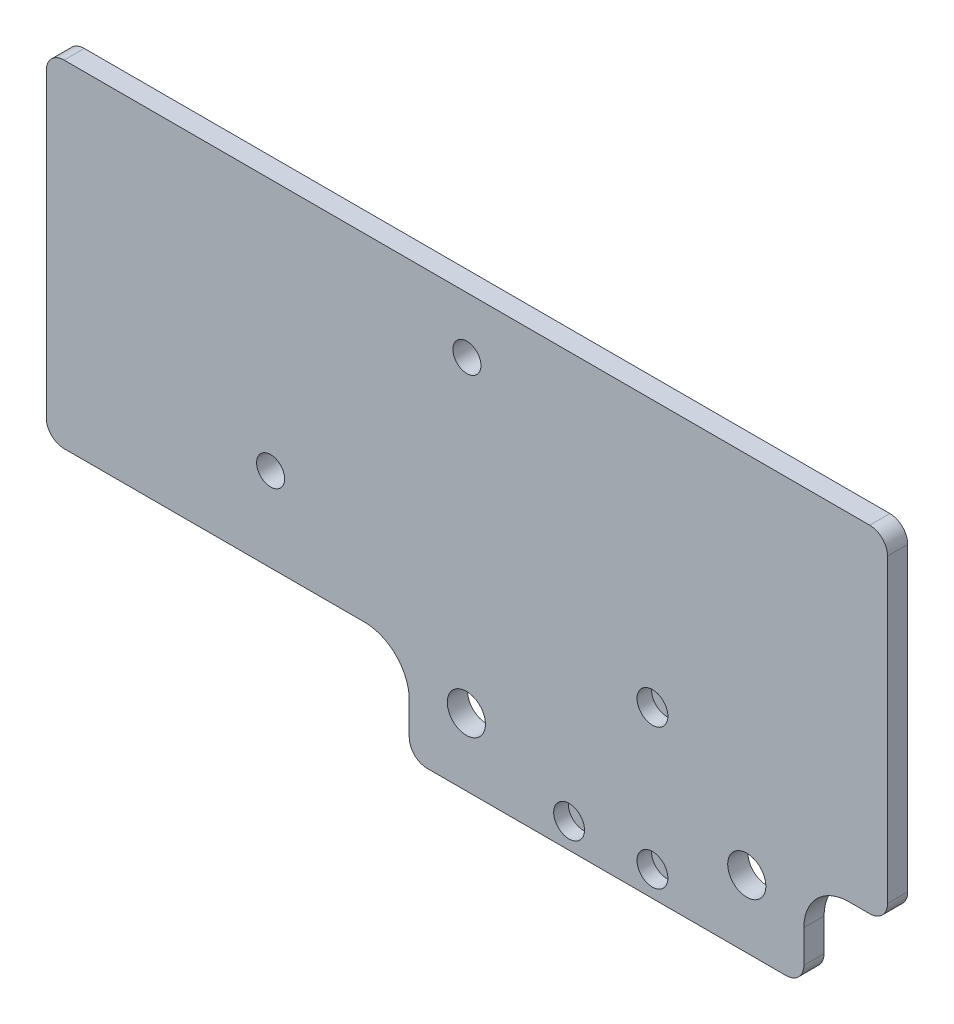
ISO-10303-21;
HEADER;
FILE_DESCRIPTION(('STEP AP214'),'2;1');
FILE_NAME('part.step','',(''),(''),'','','');
FILE_SCHEMA(('AUTOMOTIVE_DESIGN { 1 0 10303 214 1 1 1 1 }'));
ENDSEC;
DATA;
#1=APPLICATION_CONTEXT('core data for automotive mechanical design processes');
#2=APPLICATION_PROTOCOL_DEFINITION('international standard','automotive_design',2000,#1);
#3=PRODUCT_CONTEXT('',#1,'mechanical');
#4=PRODUCT('Part','Part','',(#3));
#5=PRODUCT_RELATED_PRODUCT_CATEGORY('part','',(#4));
#6=PRODUCT_DEFINITION_FORMATION('','',#4);
#7=PRODUCT_DEFINITION_CONTEXT('part definition',#1,'design');
#8=PRODUCT_DEFINITION('design','',#6,#7);
#9=PRODUCT_DEFINITION_SHAPE('','',#8);
#10=(LENGTH_UNIT() NAMED_UNIT(*) SI_UNIT(.MILLI.,.METRE.));
#11=(NAMED_UNIT(*) PLANE_ANGLE_UNIT() SI_UNIT($,.RADIAN.));
#12=(NAMED_UNIT(*) SI_UNIT($,.STERADIAN.) SOLID_ANGLE_UNIT());
#13=UNCERTAINTY_MEASURE_WITH_UNIT(LENGTH_MEASURE(1.E-05),#10,'distance_accuracy_value','');
#14=(GEOMETRIC_REPRESENTATION_CONTEXT(3) GLOBAL_UNCERTAINTY_ASSIGNED_CONTEXT((#13)) GLOBAL_UNIT_ASSIGNED_CONTEXT((#10,
#11,#12)) REPRESENTATION_CONTEXT('',''));
#15=CARTESIAN_POINT('',(0.,0.,0.));
#16=DIRECTION('',(0.,0.,1.));
#17=DIRECTION('',(1.,0.,0.));
#18=AXIS2_PLACEMENT_3D('',#15,#16,#17);
#19=CARTESIAN_POINT('',(33.0800000000001,-72.5,3.6));
#20=DIRECTION('',(0.,0.,-1.));
#21=DIRECTION('',(-1.,0.,0.));
#22=AXIS2_PLACEMENT_3D('',#19,#20,#21);
#23=CYLINDRICAL_SURFACE('',#22,2.75);
#24=CARTESIAN_POINT('',(33.0800000000001,-72.5,3.6));
#25=DIRECTION('',(0.,0.,1.));
#26=DIRECTION('',(1.,0.,0.));
#27=AXIS2_PLACEMENT_3D('',#24,#25,#26);
#28=CIRCLE('',#27,2.75);
#29=CARTESIAN_POINT('',(35.8300000000001,-72.5,3.6));
#30=VERTEX_POINT('',#29);
#31=EDGE_CURVE('E515',#30,#30,#28,.T.);
#32=ORIENTED_EDGE('',*,*,#31,.T.);
#33=EDGE_LOOP('',(#32));
#34=FACE_BOUND('',#33,.T.);
#35=CARTESIAN_POINT('',(33.0800000000001,-72.5,1.));
#36=DIRECTION('',(0.,0.,-1.));
#37=DIRECTION('',(-1.,0.,0.));
#38=AXIS2_PLACEMENT_3D('',#35,#36,#37);
#39=CIRCLE('',#38,2.75);
#40=CARTESIAN_POINT('',(30.3300000000001,-72.5,1.));
#41=VERTEX_POINT('',#40);
#42=EDGE_CURVE('E493',#41,#41,#39,.T.);
#43=ORIENTED_EDGE('',*,*,#42,.T.);
#44=EDGE_LOOP('',(#43));
#45=FACE_BOUND('',#44,.T.);
#46=ADVANCED_FACE('F38',(#34,#45),#23,.F.);
#47=CARTESIAN_POINT('',(18.22,-72.5,3.6));
#48=DIRECTION('',(0.,0.,-1.));
#49=DIRECTION('',(-1.,0.,0.));
#50=AXIS2_PLACEMENT_3D('',#47,#48,#49);
#51=CYLINDRICAL_SURFACE('',#50,2.75);
#52=CARTESIAN_POINT('',(18.22,-72.5,3.6));
#53=DIRECTION('',(0.,0.,1.));
#54=DIRECTION('',(1.,0.,0.));
#55=AXIS2_PLACEMENT_3D('',#52,#53,#54);
#56=CIRCLE('',#55,2.75);
#57=CARTESIAN_POINT('',(20.97,-72.5,3.6));
#58=VERTEX_POINT('',#57);
#59=EDGE_CURVE('E498',#58,#58,#56,.T.);
#60=ORIENTED_EDGE('',*,*,#59,.T.);
#61=EDGE_LOOP('',(#60));
#62=FACE_BOUND('',#61,.T.);
#63=CARTESIAN_POINT('',(18.22,-72.5,1.));
#64=DIRECTION('',(0.,0.,-1.));
#65=DIRECTION('',(-1.,0.,0.));
#66=AXIS2_PLACEMENT_3D('',#63,#64,#65);
#67=CIRCLE('',#66,2.75);
#68=CARTESIAN_POINT('',(15.47,-72.5,1.));
#69=VERTEX_POINT('',#68);
#70=EDGE_CURVE('E495',#69,#69,#67,.T.);
#71=ORIENTED_EDGE('',*,*,#70,.T.);
#72=EDGE_LOOP('',(#71));
#73=FACE_BOUND('',#72,.T.);
#74=ADVANCED_FACE('F320',(#62,#73),#51,.F.);
#75=CARTESIAN_POINT('',(33.0800000000001,-47.5,3.6));
#76=DIRECTION('',(0.,0.,-1.));
#77=DIRECTION('',(-1.,0.,0.));
#78=AXIS2_PLACEMENT_3D('',#75,#76,#77);
#79=CYLINDRICAL_SURFACE('',#78,2.75);
#80=CARTESIAN_POINT('',(33.0800000000001,-47.5,3.6));
#81=DIRECTION('',(0.,0.,1.));
#82=DIRECTION('',(1.,0.,0.));
#83=AXIS2_PLACEMENT_3D('',#80,#81,#82);
#84=CIRCLE('',#83,2.75);
#85=CARTESIAN_POINT('',(35.8300000000001,-47.5,3.6));
#86=VERTEX_POINT('',#85);
#87=EDGE_CURVE('E494',#86,#86,#84,.T.);
#88=ORIENTED_EDGE('',*,*,#87,.T.);
#89=EDGE_LOOP('',(#88));
#90=FACE_BOUND('',#89,.T.);
#91=CARTESIAN_POINT('',(33.0800000000001,-47.5,1.));
#92=DIRECTION('',(0.,0.,-1.));
#93=DIRECTION('',(-1.,0.,0.));
#94=AXIS2_PLACEMENT_3D('',#91,#92,#93);
#95=CIRCLE('',#94,2.75);
#96=CARTESIAN_POINT('',(30.3300000000001,-47.5,1.));
#97=VERTEX_POINT('',#96);
#98=EDGE_CURVE('E42',#97,#97,#95,.T.);
#99=ORIENTED_EDGE('',*,*,#98,.T.);
#100=EDGE_LOOP('',(#99));
#101=FACE_BOUND('',#100,.T.);
#102=ADVANCED_FACE('F326',(#90,#101),#79,.F.);
#103=CARTESIAN_POINT('',(71.82,-3.18000000000001,3.6));
#104=DIRECTION('',(0.,0.,1.));
#105=DIRECTION('',(1.,0.,0.));
#106=AXIS2_PLACEMENT_3D('',#103,#104,#105);
#107=PLANE('',#106);
#108=ORIENTED_EDGE('',*,*,#59,.F.);
#109=EDGE_LOOP('',(#108));
#110=FACE_BOUND('',#109,.T.);
#111=CARTESIAN_POINT('',(-0.0999999999999612,-65.,3.6));
#112=DIRECTION('',(0.,0.,1.));
#113=DIRECTION('',(1.,0.,0.));
#114=AXIS2_PLACEMENT_3D('',#111,#112,#113);
#115=CIRCLE('',#114,3.4);
#116=CARTESIAN_POINT('',(3.30000000000004,-65.,3.6));
#117=VERTEX_POINT('',#116);
#118=EDGE_CURVE('E512',#117,#117,#115,.T.);
#119=ORIENTED_EDGE('',*,*,#118,.F.);
#120=EDGE_LOOP('',(#119));
#121=FACE_BOUND('',#120,.T.);
#122=CARTESIAN_POINT('',(49.9,-65.,3.6));
#123=DIRECTION('',(0.,0.,1.));
#124=DIRECTION('',(1.,0.,0.));
#125=AXIS2_PLACEMENT_3D('',#122,#123,#124);
#126=CIRCLE('',#125,3.4);
#127=CARTESIAN_POINT('',(53.3,-65.,3.6));
#128=VERTEX_POINT('',#127);
#129=EDGE_CURVE('E520',#128,#128,#126,.T.);
#130=ORIENTED_EDGE('',*,*,#129,.F.);
#131=EDGE_LOOP('',(#130));
#132=FACE_BOUND('',#131,.T.);
#133=CARTESIAN_POINT('',(71.82,-3.18000000000001,3.6));
#134=DIRECTION('',(0.,0.,1.));
#135=DIRECTION('',(1.,0.,0.));
#136=AXIS2_PLACEMENT_3D('',#133,#134,#135);
#137=CIRCLE('',#136,3.18);
#138=CARTESIAN_POINT('',(75.,-3.18000000000001,3.6));
#139=VERTEX_POINT('',#138);
#140=CARTESIAN_POINT('',(71.82,0.,3.6));
#141=VERTEX_POINT('',#140);
#142=EDGE_CURVE('E216',#139,#141,#137,.T.);
#143=ORIENTED_EDGE('',*,*,#142,.T.);
#144=DIRECTION('',(-1.,0.,0.));
#145=VECTOR('',#144,1.);
#146=CARTESIAN_POINT('',(71.82,0.,3.6));
#147=LINE('',#146,#145);
#148=CARTESIAN_POINT('',(-71.82,0.,3.6));
#149=VERTEX_POINT('',#148);
#150=EDGE_CURVE('E123',#141,#149,#147,.T.);
#151=ORIENTED_EDGE('',*,*,#150,.T.);
#152=CARTESIAN_POINT('',(-71.82,-3.18000000000002,3.6));
#153=DIRECTION('',(0.,0.,1.));
#154=DIRECTION('',(1.,0.,0.));
#155=AXIS2_PLACEMENT_3D('',#152,#153,#154);
#156=CIRCLE('',#155,3.18);
#157=CARTESIAN_POINT('',(-75.,-3.18000000000002,3.6));
#158=VERTEX_POINT('',#157);
#159=EDGE_CURVE('E256',#149,#158,#156,.T.);
#160=ORIENTED_EDGE('',*,*,#159,.T.);
#161=DIRECTION('',(0.,-1.,0.));
#162=VECTOR('',#161,1.);
#163=CARTESIAN_POINT('',(-75.,-3.18000000000002,3.6));
#164=LINE('',#163,#162);
#165=CARTESIAN_POINT('',(-75.,-56.82,3.6));
#166=VERTEX_POINT('',#165);
#167=EDGE_CURVE('E276',#158,#166,#164,.T.);
#168=ORIENTED_EDGE('',*,*,#167,.T.);
#169=CARTESIAN_POINT('',(-71.82,-56.82,3.6));
#170=DIRECTION('',(0.,0.,1.));
#171=DIRECTION('',(1.,0.,0.));
#172=AXIS2_PLACEMENT_3D('',#169,#170,#171);
#173=CIRCLE('',#172,3.18000000000001);
#174=CARTESIAN_POINT('',(-71.82,-60.,3.6));
#175=VERTEX_POINT('',#174);
#176=EDGE_CURVE('E273',#166,#175,#173,.T.);
#177=ORIENTED_EDGE('',*,*,#176,.T.);
#178=DIRECTION('',(1.,0.,0.));
#179=VECTOR('',#178,1.);
#180=CARTESIAN_POINT('',(-71.82,-60.,3.6));
#181=LINE('',#180,#179);
#182=CARTESIAN_POINT('',(-18.28,-60.,3.6));
#183=VERTEX_POINT('',#182);
#184=EDGE_CURVE('E275',#175,#183,#181,.T.);
#185=ORIENTED_EDGE('',*,*,#184,.T.);
#186=CARTESIAN_POINT('',(-18.28,-68.,3.6));
#187=DIRECTION('',(0.,0.,-1.));
#188=DIRECTION('',(1.,0.,0.));
#189=AXIS2_PLACEMENT_3D('',#186,#187,#188);
#190=CIRCLE('',#189,8.);
#191=CARTESIAN_POINT('',(-10.28,-67.9999999999999,3.6));
#192=VERTEX_POINT('',#191);
#193=EDGE_CURVE('E278',#183,#192,#190,.T.);
#194=ORIENTED_EDGE('',*,*,#193,.T.);
#195=DIRECTION('',(0.,-1.,0.));
#196=VECTOR('',#195,1.);
#197=CARTESIAN_POINT('',(-10.28,-67.9999999999999,3.6));
#198=LINE('',#197,#196);
#199=CARTESIAN_POINT('',(-10.28,-73.8199999999999,3.6));
#200=VERTEX_POINT('',#199);
#201=EDGE_CURVE('E284',#192,#200,#198,.T.);
#202=ORIENTED_EDGE('',*,*,#201,.T.);
#203=CARTESIAN_POINT('',(-7.09999999999996,-73.82,3.6));
#204=DIRECTION('',(0.,0.,1.));
#205=DIRECTION('',(1.,0.,0.));
#206=AXIS2_PLACEMENT_3D('',#203,#204,#205);
#207=CIRCLE('',#206,3.18);
#208=CARTESIAN_POINT('',(-7.09999999999996,-77.,3.6));
#209=VERTEX_POINT('',#208);
#210=EDGE_CURVE('E286',#200,#209,#207,.T.);
#211=ORIENTED_EDGE('',*,*,#210,.T.);
#212=DIRECTION('',(1.,0.,0.));
#213=VECTOR('',#212,1.);
#214=CARTESIAN_POINT('',(-7.09999999999996,-77.,3.6));
#215=LINE('',#214,#213);
#216=CARTESIAN_POINT('',(56.9,-77.,3.6));
#217=VERTEX_POINT('',#216);
#218=EDGE_CURVE('E288',#209,#217,#215,.T.);
#219=ORIENTED_EDGE('',*,*,#218,.T.);
#220=CARTESIAN_POINT('',(56.9,-73.82,3.6));
#221=DIRECTION('',(0.,0.,1.));
#222=DIRECTION('',(1.,0.,0.));
#223=AXIS2_PLACEMENT_3D('',#220,#221,#222);
#224=CIRCLE('',#223,3.18);
#225=CARTESIAN_POINT('',(60.08,-73.8199999999999,3.6));
#226=VERTEX_POINT('',#225);
#227=EDGE_CURVE('E290',#217,#226,#224,.T.);
#228=ORIENTED_EDGE('',*,*,#227,.T.);
#229=DIRECTION('',(0.,1.,0.));
#230=VECTOR('',#229,1.);
#231=CARTESIAN_POINT('',(60.08,-73.8199999999999,3.6));
#232=LINE('',#231,#230);
#233=CARTESIAN_POINT('',(60.08,-67.9999999999999,3.6));
#234=VERTEX_POINT('',#233);
#235=EDGE_CURVE('E292',#226,#234,#232,.T.);
#236=ORIENTED_EDGE('',*,*,#235,.T.);
#237=CARTESIAN_POINT('',(68.08,-68.,3.6));
#238=DIRECTION('',(0.,0.,-1.));
#239=DIRECTION('',(1.,0.,0.));
#240=AXIS2_PLACEMENT_3D('',#237,#238,#239);
#241=CIRCLE('',#240,8.00000000000001);
#242=CARTESIAN_POINT('',(68.0800000000001,-60.,3.6));
#243=VERTEX_POINT('',#242);
#244=EDGE_CURVE('E167',#234,#243,#241,.T.);
#245=ORIENTED_EDGE('',*,*,#244,.T.);
#246=DIRECTION('',(1.,0.,0.));
#247=VECTOR('',#246,1.);
#248=CARTESIAN_POINT('',(68.0800000000001,-60.,3.6));
#249=LINE('',#248,#247);
#250=CARTESIAN_POINT('',(71.82,-60.,3.6));
#251=VERTEX_POINT('',#250);
#252=EDGE_CURVE('E160',#243,#251,#249,.T.);
#253=ORIENTED_EDGE('',*,*,#252,.T.);
#254=CARTESIAN_POINT('',(71.82,-56.82,3.6));
#255=DIRECTION('',(0.,0.,1.));
#256=DIRECTION('',(1.,0.,0.));
#257=AXIS2_PLACEMENT_3D('',#254,#255,#256);
#258=CIRCLE('',#257,3.18000000000001);
#259=CARTESIAN_POINT('',(75.,-56.82,3.6));
#260=VERTEX_POINT('',#259);
#261=EDGE_CURVE('E165',#251,#260,#258,.T.);
#262=ORIENTED_EDGE('',*,*,#261,.T.);
#263=DIRECTION('',(0.,1.,0.));
#264=VECTOR('',#263,1.);
#265=CARTESIAN_POINT('',(75.,-56.82,3.6));
#266=LINE('',#265,#264);
#267=EDGE_CURVE('E56',#260,#139,#266,.T.);
#268=ORIENTED_EDGE('',*,*,#267,.T.);
#269=EDGE_LOOP('',(#143,#151,#160,#168,#177,#185,#194,#202,#211,#219,#228,#236,#245,#253,#262,#268));
#270=FACE_BOUND('',#269,.T.);
#271=CARTESIAN_POINT('',(-35.,-45.,3.6));
#272=DIRECTION('',(0.,0.,1.));
#273=DIRECTION('',(1.,0.,0.));
#274=AXIS2_PLACEMENT_3D('',#271,#272,#273);
#275=CIRCLE('',#274,2.5);
#276=CARTESIAN_POINT('',(-32.5,-45.,3.6));
#277=VERTEX_POINT('',#276);
#278=EDGE_CURVE('E189',#277,#277,#275,.T.);
#279=ORIENTED_EDGE('',*,*,#278,.F.);
#280=EDGE_LOOP('',(#279));
#281=FACE_BOUND('',#280,.T.);
#282=ORIENTED_EDGE('',*,*,#31,.F.);
#283=EDGE_LOOP('',(#282));
#284=FACE_BOUND('',#283,.T.);
#285=CARTESIAN_POINT('',(0.,-9.99999999999998,3.6));
#286=DIRECTION('',(0.,0.,1.));
#287=DIRECTION('',(1.,0.,0.));
#288=AXIS2_PLACEMENT_3D('',#285,#286,#287);
#289=CIRCLE('',#288,2.5);
#290=CARTESIAN_POINT('',(2.5,-9.99999999999998,3.6));
#291=VERTEX_POINT('',#290);
#292=EDGE_CURVE('E506',#291,#291,#289,.T.);
#293=ORIENTED_EDGE('',*,*,#292,.F.);
#294=EDGE_LOOP('',(#293));
#295=FACE_BOUND('',#294,.T.);
#296=ORIENTED_EDGE('',*,*,#87,.F.);
#297=EDGE_LOOP('',(#296));
#298=FACE_BOUND('',#297,.T.);
#299=ADVANCED_FACE('F162',(#110,#121,#132,#270,#281,#284,#295,#298),#107,.T.);
#300=CARTESIAN_POINT('',(71.82,-3.18000000000001,0.));
#301=DIRECTION('',(0.,0.,1.));
#302=DIRECTION('',(1.,0.,0.));
#303=AXIS2_PLACEMENT_3D('',#300,#301,#302);
#304=PLANE('',#303);
#305=CARTESIAN_POINT('',(56.9,-73.82,0.));
#306=DIRECTION('',(0.,0.,1.));
#307=DIRECTION('',(1.,0.,0.));
#308=AXIS2_PLACEMENT_3D('',#305,#306,#307);
#309=CIRCLE('',#308,3.18);
#310=CARTESIAN_POINT('',(56.9,-77.,0.));
#311=VERTEX_POINT('',#310);
#312=CARTESIAN_POINT('',(60.08,-73.8199999999999,0.));
#313=VERTEX_POINT('',#312);
#314=EDGE_CURVE('E207',#311,#313,#309,.T.);
#315=ORIENTED_EDGE('',*,*,#314,.F.);
#316=DIRECTION('',(1.,0.,0.));
#317=VECTOR('',#316,1.);
#318=CARTESIAN_POINT('',(-7.09999999999996,-77.,0.));
#319=LINE('',#318,#317);
#320=CARTESIAN_POINT('',(-7.09999999999996,-77.,0.));
#321=VERTEX_POINT('',#320);
#322=EDGE_CURVE('E205',#321,#311,#319,.T.);
#323=ORIENTED_EDGE('',*,*,#322,.F.);
#324=CARTESIAN_POINT('',(-7.09999999999996,-73.82,0.));
#325=DIRECTION('',(0.,0.,1.));
#326=DIRECTION('',(1.,0.,0.));
#327=AXIS2_PLACEMENT_3D('',#324,#325,#326);
#328=CIRCLE('',#327,3.18);
#329=CARTESIAN_POINT('',(-10.28,-73.8199999999999,0.));
#330=VERTEX_POINT('',#329);
#331=EDGE_CURVE('E203',#330,#321,#328,.T.);
#332=ORIENTED_EDGE('',*,*,#331,.F.);
#333=DIRECTION('',(0.,-1.,0.));
#334=VECTOR('',#333,1.);
#335=CARTESIAN_POINT('',(-10.28,-67.9999999999999,0.));
#336=LINE('',#335,#334);
#337=CARTESIAN_POINT('',(-10.28,-67.9999999999999,0.));
#338=VERTEX_POINT('',#337);
#339=EDGE_CURVE('E201',#338,#330,#336,.T.);
#340=ORIENTED_EDGE('',*,*,#339,.F.);
#341=CARTESIAN_POINT('',(-18.28,-68.,0.));
#342=DIRECTION('',(0.,0.,-1.));
#343=DIRECTION('',(1.,0.,0.));
#344=AXIS2_PLACEMENT_3D('',#341,#342,#343);
#345=CIRCLE('',#344,8.);
#346=CARTESIAN_POINT('',(-18.28,-60.,0.));
#347=VERTEX_POINT('',#346);
#348=EDGE_CURVE('E199',#347,#338,#345,.T.);
#349=ORIENTED_EDGE('',*,*,#348,.F.);
#350=DIRECTION('',(1.,0.,0.));
#351=VECTOR('',#350,1.);
#352=CARTESIAN_POINT('',(-71.82,-60.,0.));
#353=LINE('',#352,#351);
#354=CARTESIAN_POINT('',(-71.82,-60.,0.));
#355=VERTEX_POINT('',#354);
#356=EDGE_CURVE('E197',#355,#347,#353,.T.);
#357=ORIENTED_EDGE('',*,*,#356,.F.);
#358=CARTESIAN_POINT('',(-71.82,-56.82,0.));
#359=DIRECTION('',(0.,0.,1.));
#360=DIRECTION('',(1.,0.,0.));
#361=AXIS2_PLACEMENT_3D('',#358,#359,#360);
#362=CIRCLE('',#361,3.18000000000001);
#363=CARTESIAN_POINT('',(-75.,-56.82,0.));
#364=VERTEX_POINT('',#363);
#365=EDGE_CURVE('E195',#364,#355,#362,.T.);
#366=ORIENTED_EDGE('',*,*,#365,.F.);
#367=DIRECTION('',(0.,-1.,0.));
#368=VECTOR('',#367,1.);
#369=CARTESIAN_POINT('',(-75.,-3.18000000000002,0.));
#370=LINE('',#369,#368);
#371=CARTESIAN_POINT('',(-75.,-3.18000000000002,0.));
#372=VERTEX_POINT('',#371);
#373=EDGE_CURVE('E193',#372,#364,#370,.T.);
#374=ORIENTED_EDGE('',*,*,#373,.F.);
#375=CARTESIAN_POINT('',(-71.82,-3.18000000000002,0.));
#376=DIRECTION('',(0.,0.,1.));
#377=DIRECTION('',(1.,0.,0.));
#378=AXIS2_PLACEMENT_3D('',#375,#376,#377);
#379=CIRCLE('',#378,3.18);
#380=CARTESIAN_POINT('',(-71.82,0.,0.));
#381=VERTEX_POINT('',#380);
#382=EDGE_CURVE('E191',#381,#372,#379,.T.);
#383=ORIENTED_EDGE('',*,*,#382,.F.);
#384=DIRECTION('',(-1.,0.,0.));
#385=VECTOR('',#384,1.);
#386=CARTESIAN_POINT('',(71.82,0.,0.));
#387=LINE('',#386,#385);
#388=CARTESIAN_POINT('',(71.82,0.,0.));
#389=VERTEX_POINT('',#388);
#390=EDGE_CURVE('E188',#389,#381,#387,.T.);
#391=ORIENTED_EDGE('',*,*,#390,.F.);
#392=CARTESIAN_POINT('',(71.82,-3.18000000000001,0.));
#393=DIRECTION('',(0.,0.,1.));
#394=DIRECTION('',(1.,0.,0.));
#395=AXIS2_PLACEMENT_3D('',#392,#393,#394);
#396=CIRCLE('',#395,3.18);
#397=CARTESIAN_POINT('',(75.,-3.18000000000001,0.));
#398=VERTEX_POINT('',#397);
#399=EDGE_CURVE('E185',#398,#389,#396,.T.);
#400=ORIENTED_EDGE('',*,*,#399,.F.);
#401=DIRECTION('',(0.,1.,0.));
#402=VECTOR('',#401,1.);
#403=CARTESIAN_POINT('',(75.,-56.82,0.));
#404=LINE('',#403,#402);
#405=CARTESIAN_POINT('',(75.,-56.82,0.));
#406=VERTEX_POINT('',#405);
#407=EDGE_CURVE('E115',#406,#398,#404,.T.);
#408=ORIENTED_EDGE('',*,*,#407,.F.);
#409=CARTESIAN_POINT('',(71.82,-56.82,0.));
#410=DIRECTION('',(0.,0.,1.));
#411=DIRECTION('',(1.,0.,0.));
#412=AXIS2_PLACEMENT_3D('',#409,#410,#411);
#413=CIRCLE('',#412,3.18000000000001);
#414=CARTESIAN_POINT('',(71.82,-60.,0.));
#415=VERTEX_POINT('',#414);
#416=EDGE_CURVE('E109',#415,#406,#413,.T.);
#417=ORIENTED_EDGE('',*,*,#416,.F.);
#418=DIRECTION('',(1.,0.,0.));
#419=VECTOR('',#418,1.);
#420=CARTESIAN_POINT('',(68.0800000000001,-60.,0.));
#421=LINE('',#420,#419);
#422=CARTESIAN_POINT('',(68.0800000000001,-60.,0.));
#423=VERTEX_POINT('',#422);
#424=EDGE_CURVE('E175',#423,#415,#421,.T.);
#425=ORIENTED_EDGE('',*,*,#424,.F.);
#426=CARTESIAN_POINT('',(68.08,-68.,0.));
#427=DIRECTION('',(0.,0.,-1.));
#428=DIRECTION('',(1.,0.,0.));
#429=AXIS2_PLACEMENT_3D('',#426,#427,#428);
#430=CIRCLE('',#429,8.00000000000001);
#431=CARTESIAN_POINT('',(60.08,-67.9999999999999,0.));
#432=VERTEX_POINT('',#431);
#433=EDGE_CURVE('E211',#432,#423,#430,.T.);
#434=ORIENTED_EDGE('',*,*,#433,.F.);
#435=DIRECTION('',(0.,1.,0.));
#436=VECTOR('',#435,1.);
#437=CARTESIAN_POINT('',(60.08,-73.8199999999999,0.));
#438=LINE('',#437,#436);
#439=EDGE_CURVE('E209',#313,#432,#438,.T.);
#440=ORIENTED_EDGE('',*,*,#439,.F.);
#441=EDGE_LOOP('',(#315,#323,#332,#340,#349,#357,#366,#374,#383,#391,#400,#408,#417,#425,#434,#440));
#442=FACE_BOUND('',#441,.T.);
#443=CARTESIAN_POINT('',(-35.,-45.,0.));
#444=DIRECTION('',(0.,0.,1.));
#445=DIRECTION('',(1.,0.,0.));
#446=AXIS2_PLACEMENT_3D('',#443,#444,#445);
#447=CIRCLE('',#446,2.5);
#448=CARTESIAN_POINT('',(-32.5,-45.,0.));
#449=VERTEX_POINT('',#448);
#450=EDGE_CURVE('E523',#449,#449,#447,.T.);
#451=ORIENTED_EDGE('',*,*,#450,.T.);
#452=EDGE_LOOP('',(#451));
#453=FACE_BOUND('',#452,.T.);
#454=CARTESIAN_POINT('',(49.9,-65.,0.));
#455=DIRECTION('',(0.,0.,1.));
#456=DIRECTION('',(1.,0.,0.));
#457=AXIS2_PLACEMENT_3D('',#454,#455,#456);
#458=CIRCLE('',#457,3.4);
#459=CARTESIAN_POINT('',(53.3,-65.,0.));
#460=VERTEX_POINT('',#459);
#461=EDGE_CURVE('E519',#460,#460,#458,.T.);
#462=ORIENTED_EDGE('',*,*,#461,.T.);
#463=EDGE_LOOP('',(#462));
#464=FACE_BOUND('',#463,.T.);
#465=CARTESIAN_POINT('',(-0.0999999999999612,-65.,0.));
#466=DIRECTION('',(0.,0.,1.));
#467=DIRECTION('',(1.,0.,0.));
#468=AXIS2_PLACEMENT_3D('',#465,#466,#467);
#469=CIRCLE('',#468,3.4);
#470=CARTESIAN_POINT('',(3.30000000000004,-65.,0.));
#471=VERTEX_POINT('',#470);
#472=EDGE_CURVE('E509',#471,#471,#469,.T.);
#473=ORIENTED_EDGE('',*,*,#472,.T.);
#474=EDGE_LOOP('',(#473));
#475=FACE_BOUND('',#474,.T.);
#476=CARTESIAN_POINT('',(0.,-9.99999999999998,0.));
#477=DIRECTION('',(0.,0.,1.));
#478=DIRECTION('',(1.,0.,0.));
#479=AXIS2_PLACEMENT_3D('',#476,#477,#478);
#480=CIRCLE('',#479,2.5);
#481=CARTESIAN_POINT('',(2.5,-9.99999999999998,0.));
#482=VERTEX_POINT('',#481);
#483=EDGE_CURVE('E505',#482,#482,#480,.T.);
#484=ORIENTED_EDGE('',*,*,#483,.T.);
#485=EDGE_LOOP('',(#484));
#486=FACE_BOUND('',#485,.T.);
#487=ADVANCED_FACE('F260',(#442,#453,#464,#475,#486),#304,.F.);
#488=CARTESIAN_POINT('',(71.82,-3.18000000000001,3.6));
#489=DIRECTION('',(0.,0.,-1.));
#490=DIRECTION('',(-1.,0.,0.));
#491=AXIS2_PLACEMENT_3D('',#488,#489,#490);
#492=CYLINDRICAL_SURFACE('',#491,3.18);
#493=ORIENTED_EDGE('',*,*,#399,.T.);
#494=DIRECTION('',(0.,0.,-1.));
#495=VECTOR('',#494,1.);
#496=CARTESIAN_POINT('',(71.82,0.,3.6));
#497=LINE('',#496,#495);
#498=EDGE_CURVE('E11',#141,#389,#497,.T.);
#499=ORIENTED_EDGE('',*,*,#498,.F.);
#500=ORIENTED_EDGE('',*,*,#142,.F.);
#501=DIRECTION('',(0.,0.,-1.));
#502=VECTOR('',#501,1.);
#503=CARTESIAN_POINT('',(75.,-3.18000000000001,3.6));
#504=LINE('',#503,#502);
#505=EDGE_CURVE('E181',#139,#398,#504,.T.);
#506=ORIENTED_EDGE('',*,*,#505,.T.);
#507=EDGE_LOOP('',(#493,#499,#500,#506));
#508=FACE_BOUND('',#507,.T.);
#509=ADVANCED_FACE('F40',(#508),#492,.T.);
#510=CARTESIAN_POINT('',(71.82,0.,3.6));
#511=DIRECTION('',(0.,-1.,0.));
#512=DIRECTION('',(1.,0.,0.));
#513=AXIS2_PLACEMENT_3D('',#510,#511,#512);
#514=PLANE('',#513);
#515=ORIENTED_EDGE('',*,*,#390,.T.);
#516=DIRECTION('',(0.,0.,-1.));
#517=VECTOR('',#516,1.);
#518=CARTESIAN_POINT('',(-71.82,0.,3.6));
#519=LINE('',#518,#517);
#520=EDGE_CURVE('E48',#149,#381,#519,.T.);
#521=ORIENTED_EDGE('',*,*,#520,.F.);
#522=ORIENTED_EDGE('',*,*,#150,.F.);
#523=ORIENTED_EDGE('',*,*,#498,.T.);
#524=EDGE_LOOP('',(#515,#521,#522,#523));
#525=FACE_BOUND('',#524,.T.);
#526=ADVANCED_FACE('F344',(#525),#514,.F.);
#527=CARTESIAN_POINT('',(-71.82,-3.18000000000002,3.6));
#528=DIRECTION('',(0.,0.,-1.));
#529=DIRECTION('',(-1.,0.,0.));
#530=AXIS2_PLACEMENT_3D('',#527,#528,#529);
#531=CYLINDRICAL_SURFACE('',#530,3.18);
#532=ORIENTED_EDGE('',*,*,#382,.T.);
#533=DIRECTION('',(0.,0.,-1.));
#534=VECTOR('',#533,1.);
#535=CARTESIAN_POINT('',(-75.,-3.18000000000002,3.6));
#536=LINE('',#535,#534);
#537=EDGE_CURVE('E247',#158,#372,#536,.T.);
#538=ORIENTED_EDGE('',*,*,#537,.F.);
#539=ORIENTED_EDGE('',*,*,#159,.F.);
#540=ORIENTED_EDGE('',*,*,#520,.T.);
#541=EDGE_LOOP('',(#532,#538,#539,#540));
#542=FACE_BOUND('',#541,.T.);
#543=ADVANCED_FACE('F254',(#542),#531,.T.);
#544=CARTESIAN_POINT('',(-75.,-3.18000000000002,3.6));
#545=DIRECTION('',(1.,0.,0.));
#546=DIRECTION('',(0.,0.,-1.));
#547=AXIS2_PLACEMENT_3D('',#544,#545,#546);
#548=PLANE('',#547);
#549=ORIENTED_EDGE('',*,*,#373,.T.);
#550=DIRECTION('',(0.,0.,-1.));
#551=VECTOR('',#550,1.);
#552=CARTESIAN_POINT('',(-75.,-56.82,3.6));
#553=LINE('',#552,#551);
#554=EDGE_CURVE('E244',#166,#364,#553,.T.);
#555=ORIENTED_EDGE('',*,*,#554,.F.);
#556=ORIENTED_EDGE('',*,*,#167,.F.);
#557=ORIENTED_EDGE('',*,*,#537,.T.);
#558=EDGE_LOOP('',(#549,#555,#556,#557));
#559=FACE_BOUND('',#558,.T.);
#560=ADVANCED_FACE('F267',(#559),#548,.F.);
#561=CARTESIAN_POINT('',(-71.82,-56.82,3.6));
#562=DIRECTION('',(0.,0.,-1.));
#563=DIRECTION('',(-1.,0.,0.));
#564=AXIS2_PLACEMENT_3D('',#561,#562,#563);
#565=CYLINDRICAL_SURFACE('',#564,3.18000000000001);
#566=ORIENTED_EDGE('',*,*,#365,.T.);
#567=DIRECTION('',(0.,0.,-1.));
#568=VECTOR('',#567,1.);
#569=CARTESIAN_POINT('',(-71.82,-60.,3.6));
#570=LINE('',#569,#568);
#571=EDGE_CURVE('E241',#175,#355,#570,.T.);
#572=ORIENTED_EDGE('',*,*,#571,.F.);
#573=ORIENTED_EDGE('',*,*,#176,.F.);
#574=ORIENTED_EDGE('',*,*,#554,.T.);
#575=EDGE_LOOP('',(#566,#572,#573,#574));
#576=FACE_BOUND('',#575,.T.);
#577=ADVANCED_FACE('F271',(#576),#565,.T.);
#578=CARTESIAN_POINT('',(-71.82,-60.,3.6));
#579=DIRECTION('',(0.,1.,0.));
#580=DIRECTION('',(0.,0.,1.));
#581=AXIS2_PLACEMENT_3D('',#578,#579,#580);
#582=PLANE('',#581);
#583=ORIENTED_EDGE('',*,*,#356,.T.);
#584=DIRECTION('',(0.,0.,-1.));
#585=VECTOR('',#584,1.);
#586=CARTESIAN_POINT('',(-18.28,-60.,3.6));
#587=LINE('',#586,#585);
#588=EDGE_CURVE('E238',#183,#347,#587,.T.);
#589=ORIENTED_EDGE('',*,*,#588,.F.);
#590=ORIENTED_EDGE('',*,*,#184,.F.);
#591=ORIENTED_EDGE('',*,*,#571,.T.);
#592=EDGE_LOOP('',(#583,#589,#590,#591));
#593=FACE_BOUND('',#592,.T.);
#594=ADVANCED_FACE('F357',(#593),#582,.F.);
#595=CARTESIAN_POINT('',(-18.28,-68.,3.6));
#596=DIRECTION('',(0.,0.,-1.));
#597=DIRECTION('',(-1.,0.,0.));
#598=AXIS2_PLACEMENT_3D('',#595,#596,#597);
#599=CYLINDRICAL_SURFACE('',#598,8.);
#600=ORIENTED_EDGE('',*,*,#348,.T.);
#601=DIRECTION('',(0.,0.,-1.));
#602=VECTOR('',#601,1.);
#603=CARTESIAN_POINT('',(-10.28,-67.9999999999999,3.6));
#604=LINE('',#603,#602);
#605=EDGE_CURVE('E235',#192,#338,#604,.T.);
#606=ORIENTED_EDGE('',*,*,#605,.F.);
#607=ORIENTED_EDGE('',*,*,#193,.F.);
#608=ORIENTED_EDGE('',*,*,#588,.T.);
#609=EDGE_LOOP('',(#600,#606,#607,#608));
#610=FACE_BOUND('',#609,.T.);
#611=ADVANCED_FACE('F360',(#610),#599,.F.);
#612=CARTESIAN_POINT('',(-10.28,-67.9999999999999,3.6));
#613=DIRECTION('',(1.,0.,0.));
#614=DIRECTION('',(0.,1.,0.));
#615=AXIS2_PLACEMENT_3D('',#612,#613,#614);
#616=PLANE('',#615);
#617=ORIENTED_EDGE('',*,*,#339,.T.);
#618=DIRECTION('',(0.,0.,-1.));
#619=VECTOR('',#618,1.);
#620=CARTESIAN_POINT('',(-10.28,-73.8199999999999,3.6));
#621=LINE('',#620,#619);
#622=EDGE_CURVE('E232',#200,#330,#621,.T.);
#623=ORIENTED_EDGE('',*,*,#622,.F.);
#624=ORIENTED_EDGE('',*,*,#201,.F.);
#625=ORIENTED_EDGE('',*,*,#605,.T.);
#626=EDGE_LOOP('',(#617,#623,#624,#625));
#627=FACE_BOUND('',#626,.T.);
#628=ADVANCED_FACE('F364',(#627),#616,.F.);
#629=CARTESIAN_POINT('',(-7.09999999999996,-73.82,3.6));
#630=DIRECTION('',(0.,0.,-1.));
#631=DIRECTION('',(-1.,0.,0.));
#632=AXIS2_PLACEMENT_3D('',#629,#630,#631);
#633=CYLINDRICAL_SURFACE('',#632,3.18);
#634=ORIENTED_EDGE('',*,*,#331,.T.);
#635=DIRECTION('',(0.,0.,-1.));
#636=VECTOR('',#635,1.);
#637=CARTESIAN_POINT('',(-7.09999999999996,-77.,3.6));
#638=LINE('',#637,#636);
#639=EDGE_CURVE('E229',#209,#321,#638,.T.);
#640=ORIENTED_EDGE('',*,*,#639,.F.);
#641=ORIENTED_EDGE('',*,*,#210,.F.);
#642=ORIENTED_EDGE('',*,*,#622,.T.);
#643=EDGE_LOOP('',(#634,#640,#641,#642));
#644=FACE_BOUND('',#643,.T.);
#645=ADVANCED_FACE('F368',(#644),#633,.T.);
#646=CARTESIAN_POINT('',(-7.09999999999996,-77.,3.6));
#647=DIRECTION('',(0.,1.,0.));
#648=DIRECTION('',(0.,0.,1.));
#649=AXIS2_PLACEMENT_3D('',#646,#647,#648);
#650=PLANE('',#649);
#651=ORIENTED_EDGE('',*,*,#322,.T.);
#652=DIRECTION('',(0.,0.,-1.));
#653=VECTOR('',#652,1.);
#654=CARTESIAN_POINT('',(56.9,-77.,3.6));
#655=LINE('',#654,#653);
#656=EDGE_CURVE('E226',#217,#311,#655,.T.);
#657=ORIENTED_EDGE('',*,*,#656,.F.);
#658=ORIENTED_EDGE('',*,*,#218,.F.);
#659=ORIENTED_EDGE('',*,*,#639,.T.);
#660=EDGE_LOOP('',(#651,#657,#658,#659));
#661=FACE_BOUND('',#660,.T.);
#662=ADVANCED_FACE('F372',(#661),#650,.F.);
#663=CARTESIAN_POINT('',(56.9,-73.82,3.6));
#664=DIRECTION('',(0.,0.,-1.));
#665=DIRECTION('',(-1.,0.,0.));
#666=AXIS2_PLACEMENT_3D('',#663,#664,#665);
#667=CYLINDRICAL_SURFACE('',#666,3.18);
#668=ORIENTED_EDGE('',*,*,#314,.T.);
#669=DIRECTION('',(0.,0.,-1.));
#670=VECTOR('',#669,1.);
#671=CARTESIAN_POINT('',(60.08,-73.8199999999999,3.6));
#672=LINE('',#671,#670);
#673=EDGE_CURVE('E223',#226,#313,#672,.T.);
#674=ORIENTED_EDGE('',*,*,#673,.F.);
#675=ORIENTED_EDGE('',*,*,#227,.F.);
#676=ORIENTED_EDGE('',*,*,#656,.T.);
#677=EDGE_LOOP('',(#668,#674,#675,#676));
#678=FACE_BOUND('',#677,.T.);
#679=ADVANCED_FACE('F376',(#678),#667,.T.);
#680=CARTESIAN_POINT('',(60.08,-73.8199999999999,3.6));
#681=DIRECTION('',(-1.,0.,0.));
#682=DIRECTION('',(0.,-1.,0.));
#683=AXIS2_PLACEMENT_3D('',#680,#681,#682);
#684=PLANE('',#683);
#685=ORIENTED_EDGE('',*,*,#439,.T.);
#686=DIRECTION('',(0.,0.,-1.));
#687=VECTOR('',#686,1.);
#688=CARTESIAN_POINT('',(60.08,-67.9999999999999,3.6));
#689=LINE('',#688,#687);
#690=EDGE_CURVE('E220',#234,#432,#689,.T.);
#691=ORIENTED_EDGE('',*,*,#690,.F.);
#692=ORIENTED_EDGE('',*,*,#235,.F.);
#693=ORIENTED_EDGE('',*,*,#673,.T.);
#694=EDGE_LOOP('',(#685,#691,#692,#693));
#695=FACE_BOUND('',#694,.T.);
#696=ADVANCED_FACE('F298',(#695),#684,.F.);
#697=CARTESIAN_POINT('',(68.08,-68.,3.6));
#698=DIRECTION('',(0.,0.,-1.));
#699=DIRECTION('',(-1.,0.,0.));
#700=AXIS2_PLACEMENT_3D('',#697,#698,#699);
#701=CYLINDRICAL_SURFACE('',#700,8.00000000000001);
#702=ORIENTED_EDGE('',*,*,#433,.T.);
#703=DIRECTION('',(0.,0.,-1.));
#704=VECTOR('',#703,1.);
#705=CARTESIAN_POINT('',(68.0800000000001,-60.,3.6));
#706=LINE('',#705,#704);
#707=EDGE_CURVE('E176',#243,#423,#706,.T.);
#708=ORIENTED_EDGE('',*,*,#707,.F.);
#709=ORIENTED_EDGE('',*,*,#244,.F.);
#710=ORIENTED_EDGE('',*,*,#690,.T.);
#711=EDGE_LOOP('',(#702,#708,#709,#710));
#712=FACE_BOUND('',#711,.T.);
#713=ADVANCED_FACE('F302',(#712),#701,.F.);
#714=CARTESIAN_POINT('',(68.0800000000001,-60.,3.6));
#715=DIRECTION('',(0.,1.,0.));
#716=DIRECTION('',(-1.,0.,0.));
#717=AXIS2_PLACEMENT_3D('',#714,#715,#716);
#718=PLANE('',#717);
#719=ORIENTED_EDGE('',*,*,#424,.T.);
#720=DIRECTION('',(0.,0.,-1.));
#721=VECTOR('',#720,1.);
#722=CARTESIAN_POINT('',(71.82,-60.,3.6));
#723=LINE('',#722,#721);
#724=EDGE_CURVE('E172',#251,#415,#723,.T.);
#725=ORIENTED_EDGE('',*,*,#724,.F.);
#726=ORIENTED_EDGE('',*,*,#252,.F.);
#727=ORIENTED_EDGE('',*,*,#707,.T.);
#728=EDGE_LOOP('',(#719,#725,#726,#727));
#729=FACE_BOUND('',#728,.T.);
#730=ADVANCED_FACE('F173',(#729),#718,.F.);
#731=CARTESIAN_POINT('',(71.82,-56.82,3.6));
#732=DIRECTION('',(0.,0.,-1.));
#733=DIRECTION('',(-1.,0.,0.));
#734=AXIS2_PLACEMENT_3D('',#731,#732,#733);
#735=CYLINDRICAL_SURFACE('',#734,3.18000000000001);
#736=ORIENTED_EDGE('',*,*,#416,.T.);
#737=DIRECTION('',(0.,0.,-1.));
#738=VECTOR('',#737,1.);
#739=CARTESIAN_POINT('',(75.,-56.82,3.6));
#740=LINE('',#739,#738);
#741=EDGE_CURVE('E177',#260,#406,#740,.T.);
#742=ORIENTED_EDGE('',*,*,#741,.F.);
#743=ORIENTED_EDGE('',*,*,#261,.F.);
#744=ORIENTED_EDGE('',*,*,#724,.T.);
#745=EDGE_LOOP('',(#736,#742,#743,#744));
#746=FACE_BOUND('',#745,.T.);
#747=ADVANCED_FACE('F179',(#746),#735,.T.);
#748=CARTESIAN_POINT('',(75.,-56.82,3.6));
#749=DIRECTION('',(-1.,0.,0.));
#750=DIRECTION('',(0.,-1.,0.));
#751=AXIS2_PLACEMENT_3D('',#748,#749,#750);
#752=PLANE('',#751);
#753=ORIENTED_EDGE('',*,*,#407,.T.);
#754=ORIENTED_EDGE('',*,*,#505,.F.);
#755=ORIENTED_EDGE('',*,*,#267,.F.);
#756=ORIENTED_EDGE('',*,*,#741,.T.);
#757=EDGE_LOOP('',(#753,#754,#755,#756));
#758=FACE_BOUND('',#757,.T.);
#759=ADVANCED_FACE('F306',(#758),#752,.F.);
#760=CARTESIAN_POINT('',(-35.,-45.,3.6));
#761=DIRECTION('',(0.,0.,-1.));
#762=DIRECTION('',(-1.,0.,0.));
#763=AXIS2_PLACEMENT_3D('',#760,#761,#762);
#764=CYLINDRICAL_SURFACE('',#763,2.5);
#765=ORIENTED_EDGE('',*,*,#278,.T.);
#766=EDGE_LOOP('',(#765));
#767=FACE_BOUND('',#766,.T.);
#768=ORIENTED_EDGE('',*,*,#450,.F.);
#769=EDGE_LOOP('',(#768));
#770=FACE_BOUND('',#769,.T.);
#771=ADVANCED_FACE('F308',(#767,#770),#764,.F.);
#772=CARTESIAN_POINT('',(49.9,-65.,3.6));
#773=DIRECTION('',(0.,0.,-1.));
#774=DIRECTION('',(-1.,0.,0.));
#775=AXIS2_PLACEMENT_3D('',#772,#773,#774);
#776=CYLINDRICAL_SURFACE('',#775,3.4);
#777=ORIENTED_EDGE('',*,*,#129,.T.);
#778=EDGE_LOOP('',(#777));
#779=FACE_BOUND('',#778,.T.);
#780=ORIENTED_EDGE('',*,*,#461,.F.);
#781=EDGE_LOOP('',(#780));
#782=FACE_BOUND('',#781,.T.);
#783=ADVANCED_FACE('F314',(#779,#782),#776,.F.);
#784=CARTESIAN_POINT('',(-0.0999999999999612,-65.,3.6));
#785=DIRECTION('',(0.,0.,-1.));
#786=DIRECTION('',(-1.,0.,0.));
#787=AXIS2_PLACEMENT_3D('',#784,#785,#786);
#788=CYLINDRICAL_SURFACE('',#787,3.4);
#789=ORIENTED_EDGE('',*,*,#118,.T.);
#790=EDGE_LOOP('',(#789));
#791=FACE_BOUND('',#790,.T.);
#792=ORIENTED_EDGE('',*,*,#472,.F.);
#793=EDGE_LOOP('',(#792));
#794=FACE_BOUND('',#793,.T.);
#795=ADVANCED_FACE('F333',(#791,#794),#788,.F.);
#796=CARTESIAN_POINT('',(0.,-9.99999999999998,3.6));
#797=DIRECTION('',(0.,0.,-1.));
#798=DIRECTION('',(-1.,0.,0.));
#799=AXIS2_PLACEMENT_3D('',#796,#797,#798);
#800=CYLINDRICAL_SURFACE('',#799,2.5);
#801=ORIENTED_EDGE('',*,*,#292,.T.);
#802=EDGE_LOOP('',(#801));
#803=FACE_BOUND('',#802,.T.);
#804=ORIENTED_EDGE('',*,*,#483,.F.);
#805=EDGE_LOOP('',(#804));
#806=FACE_BOUND('',#805,.T.);
#807=ADVANCED_FACE('F419',(#803,#806),#800,.F.);
#808=CARTESIAN_POINT('',(0.,0.,1.));
#809=DIRECTION('',(0.,0.,-1.));
#810=DIRECTION('',(-1.,0.,0.));
#811=AXIS2_PLACEMENT_3D('',#808,#809,#810);
#812=PLANE('',#811);
#813=ORIENTED_EDGE('',*,*,#98,.F.);
#814=EDGE_LOOP('',(#813));
#815=FACE_BOUND('',#814,.T.);
#816=ADVANCED_FACE('F427',(#815),#812,.F.);
#817=ORIENTED_EDGE('',*,*,#70,.F.);
#818=EDGE_LOOP('',(#817));
#819=FACE_BOUND('',#818,.T.);
#820=ADVANCED_FACE('F469',(#819),#812,.F.);
#821=ORIENTED_EDGE('',*,*,#42,.F.);
#822=EDGE_LOOP('',(#821));
#823=FACE_BOUND('',#822,.T.);
#824=ADVANCED_FACE('F472',(#823),#812,.F.);
#825=CLOSED_SHELL('',(#46,#74,#102,#299,#487,#509,#526,#543,#560,#577,#594,#611,#628,#645,#662,
#679,#696,#713,#730,#747,#759,#771,#783,#795,#807,#816,#820,#824));
#826=MANIFOLD_SOLID_BREP('B2',#825);
#827=ADVANCED_BREP_SHAPE_REPRESENTATION('',(#18,#826),#14);
#828=SHAPE_DEFINITION_REPRESENTATION(#9,#827);
ENDSEC;
END-ISO-10303-21;
